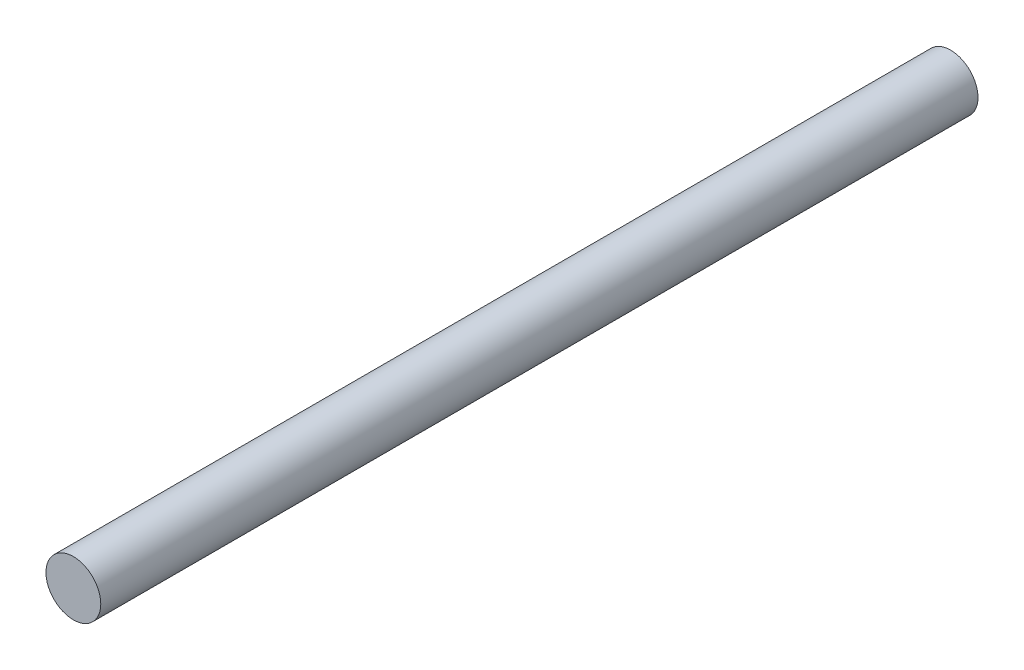
ISO-10303-21;
HEADER;
FILE_DESCRIPTION(('STEP AP214'),'2;1');
FILE_NAME('part.step','',(''),(''),'','','');
FILE_SCHEMA(('AUTOMOTIVE_DESIGN { 1 0 10303 214 1 1 1 1 }'));
ENDSEC;
DATA;
#1=APPLICATION_CONTEXT('core data for automotive mechanical design processes');
#2=APPLICATION_PROTOCOL_DEFINITION('international standard','automotive_design',2000,#1);
#3=PRODUCT_CONTEXT('',#1,'mechanical');
#4=PRODUCT('Part','Part','',(#3));
#5=PRODUCT_RELATED_PRODUCT_CATEGORY('part','',(#4));
#6=PRODUCT_DEFINITION_FORMATION('','',#4);
#7=PRODUCT_DEFINITION_CONTEXT('part definition',#1,'design');
#8=PRODUCT_DEFINITION('design','',#6,#7);
#9=PRODUCT_DEFINITION_SHAPE('','',#8);
#10=(LENGTH_UNIT() NAMED_UNIT(*) SI_UNIT(.MILLI.,.METRE.));
#11=(NAMED_UNIT(*) PLANE_ANGLE_UNIT() SI_UNIT($,.RADIAN.));
#12=(NAMED_UNIT(*) SI_UNIT($,.STERADIAN.) SOLID_ANGLE_UNIT());
#13=UNCERTAINTY_MEASURE_WITH_UNIT(LENGTH_MEASURE(1.E-05),#10,'distance_accuracy_value','');
#14=(GEOMETRIC_REPRESENTATION_CONTEXT(3) GLOBAL_UNCERTAINTY_ASSIGNED_CONTEXT((#13)) GLOBAL_UNIT_ASSIGNED_CONTEXT((#10,
#11,#12)) REPRESENTATION_CONTEXT('',''));
#15=CARTESIAN_POINT('',(0.,0.,0.));
#16=DIRECTION('',(0.,0.,1.));
#17=DIRECTION('',(1.,0.,0.));
#18=AXIS2_PLACEMENT_3D('',#15,#16,#17);
#19=CARTESIAN_POINT('',(0.,0.,38.1));
#20=DIRECTION('',(0.,0.,-1.));
#21=DIRECTION('',(-1.,0.,0.));
#22=AXIS2_PLACEMENT_3D('',#19,#20,#21);
#23=CYLINDRICAL_SURFACE('',#22,2.38125);
#24=CARTESIAN_POINT('',(0.,0.,38.1));
#25=DIRECTION('',(0.,0.,1.));
#26=DIRECTION('',(1.,0.,0.));
#27=AXIS2_PLACEMENT_3D('',#24,#25,#26);
#28=CIRCLE('',#27,2.38125);
#29=CARTESIAN_POINT('',(2.38125,0.,38.1));
#30=VERTEX_POINT('',#29);
#31=EDGE_CURVE('E10',#30,#30,#28,.T.);
#32=ORIENTED_EDGE('',*,*,#31,.F.);
#33=EDGE_LOOP('',(#32));
#34=FACE_BOUND('',#33,.T.);
#35=CARTESIAN_POINT('',(0.,0.,-38.1));
#36=DIRECTION('',(0.,0.,1.));
#37=DIRECTION('',(1.,0.,0.));
#38=AXIS2_PLACEMENT_3D('',#35,#36,#37);
#39=CIRCLE('',#38,2.38125);
#40=CARTESIAN_POINT('',(2.38125,0.,-38.1));
#41=VERTEX_POINT('',#40);
#42=EDGE_CURVE('E34',#41,#41,#39,.T.);
#43=ORIENTED_EDGE('',*,*,#42,.T.);
#44=EDGE_LOOP('',(#43));
#45=FACE_BOUND('',#44,.T.);
#46=ADVANCED_FACE('F31',(#34,#45),#23,.T.);
#47=CARTESIAN_POINT('',(0.,0.,38.1));
#48=DIRECTION('',(0.,0.,1.));
#49=DIRECTION('',(1.,0.,0.));
#50=AXIS2_PLACEMENT_3D('',#47,#48,#49);
#51=PLANE('',#50);
#52=ORIENTED_EDGE('',*,*,#31,.T.);
#53=EDGE_LOOP('',(#52));
#54=FACE_BOUND('',#53,.T.);
#55=ADVANCED_FACE('F46',(#54),#51,.T.);
#56=CARTESIAN_POINT('',(0.,0.,-38.1));
#57=DIRECTION('',(0.,0.,1.));
#58=DIRECTION('',(1.,0.,0.));
#59=AXIS2_PLACEMENT_3D('',#56,#57,#58);
#60=PLANE('',#59);
#61=ORIENTED_EDGE('',*,*,#42,.F.);
#62=EDGE_LOOP('',(#61));
#63=FACE_BOUND('',#62,.T.);
#64=ADVANCED_FACE('F44',(#63),#60,.F.);
#65=CLOSED_SHELL('',(#46,#55,#64));
#66=MANIFOLD_SOLID_BREP('B2',#65);
#67=ADVANCED_BREP_SHAPE_REPRESENTATION('',(#18,#66),#14);
#68=SHAPE_DEFINITION_REPRESENTATION(#9,#67);
ENDSEC;
END-ISO-10303-21;
